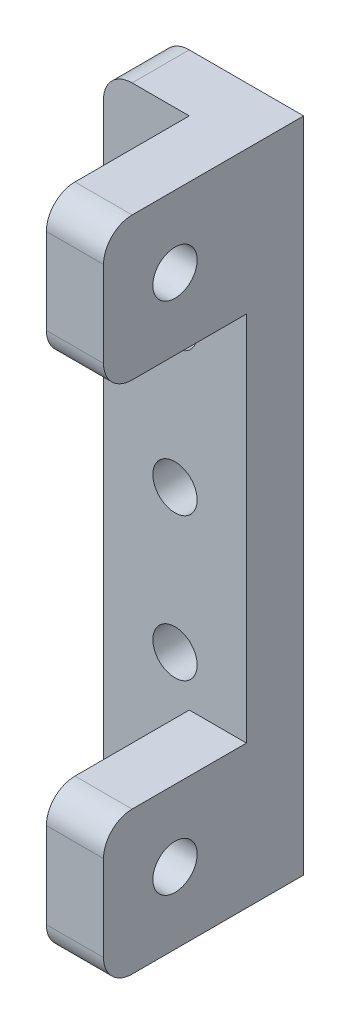
ISO-10303-21;
HEADER;
FILE_DESCRIPTION(('STEP AP214'),'2;1');
FILE_NAME('part.step','',(''),(''),'','','');
FILE_SCHEMA(('AUTOMOTIVE_DESIGN { 1 0 10303 214 1 1 1 1 }'));
ENDSEC;
DATA;
#1=APPLICATION_CONTEXT('core data for automotive mechanical design processes');
#2=APPLICATION_PROTOCOL_DEFINITION('international standard','automotive_design',2000,#1);
#3=PRODUCT_CONTEXT('',#1,'mechanical');
#4=PRODUCT('Part','Part','',(#3));
#5=PRODUCT_RELATED_PRODUCT_CATEGORY('part','',(#4));
#6=PRODUCT_DEFINITION_FORMATION('','',#4);
#7=PRODUCT_DEFINITION_CONTEXT('part definition',#1,'design');
#8=PRODUCT_DEFINITION('design','',#6,#7);
#9=PRODUCT_DEFINITION_SHAPE('','',#8);
#10=(LENGTH_UNIT() NAMED_UNIT(*) SI_UNIT(.MILLI.,.METRE.));
#11=(NAMED_UNIT(*) PLANE_ANGLE_UNIT() SI_UNIT($,.RADIAN.));
#12=(NAMED_UNIT(*) SI_UNIT($,.STERADIAN.) SOLID_ANGLE_UNIT());
#13=UNCERTAINTY_MEASURE_WITH_UNIT(LENGTH_MEASURE(1.E-05),#10,'distance_accuracy_value','');
#14=(GEOMETRIC_REPRESENTATION_CONTEXT(3) GLOBAL_UNCERTAINTY_ASSIGNED_CONTEXT((#13)) GLOBAL_UNIT_ASSIGNED_CONTEXT((#10,
#11,#12)) REPRESENTATION_CONTEXT('',''));
#15=CARTESIAN_POINT('',(0.,0.,0.));
#16=DIRECTION('',(0.,0.,1.));
#17=DIRECTION('',(1.,0.,0.));
#18=AXIS2_PLACEMENT_3D('',#15,#16,#17);
#19=CARTESIAN_POINT('',(0.,0.,4.));
#20=DIRECTION('',(0.,0.,-1.));
#21=DIRECTION('',(-1.,0.,0.));
#22=AXIS2_PLACEMENT_3D('',#19,#20,#21);
#23=PLANE('',#22);
#24=CARTESIAN_POINT('',(0.,10.,4.));
#25=DIRECTION('',(0.,0.,1.));
#26=DIRECTION('',(1.,0.,0.));
#27=AXIS2_PLACEMENT_3D('',#24,#25,#26);
#28=CIRCLE('',#27,1.55);
#29=CARTESIAN_POINT('',(1.55,10.,4.));
#30=VERTEX_POINT('',#29);
#31=EDGE_CURVE('E193',#30,#30,#28,.T.);
#32=ORIENTED_EDGE('',*,*,#31,.F.);
#33=EDGE_LOOP('',(#32));
#34=FACE_BOUND('',#33,.T.);
#35=CARTESIAN_POINT('',(0.,0.,4.));
#36=DIRECTION('',(0.,0.,1.));
#37=DIRECTION('',(1.,0.,0.));
#38=AXIS2_PLACEMENT_3D('',#35,#36,#37);
#39=CIRCLE('',#38,1.55);
#40=CARTESIAN_POINT('',(1.55,0.,4.));
#41=VERTEX_POINT('',#40);
#42=EDGE_CURVE('E187',#41,#41,#39,.T.);
#43=ORIENTED_EDGE('',*,*,#42,.F.);
#44=EDGE_LOOP('',(#43));
#45=FACE_BOUND('',#44,.T.);
#46=CARTESIAN_POINT('',(0.,-10.,4.));
#47=DIRECTION('',(0.,0.,1.));
#48=DIRECTION('',(1.,0.,0.));
#49=AXIS2_PLACEMENT_3D('',#46,#47,#48);
#50=CIRCLE('',#49,1.55);
#51=CARTESIAN_POINT('',(1.55,-10.,4.));
#52=VERTEX_POINT('',#51);
#53=EDGE_CURVE('E181',#52,#52,#50,.T.);
#54=ORIENTED_EDGE('',*,*,#53,.F.);
#55=EDGE_LOOP('',(#54));
#56=FACE_BOUND('',#55,.T.);
#57=DIRECTION('',(-1.,0.,0.));
#58=VECTOR('',#57,1.);
#59=CARTESIAN_POINT('',(-5.,23.,4.));
#60=LINE('',#59,#58);
#61=CARTESIAN_POINT('',(0.999999999999999,23.,4.));
#62=VERTEX_POINT('',#61);
#63=CARTESIAN_POINT('',(-3.,23.,4.));
#64=VERTEX_POINT('',#63);
#65=EDGE_CURVE('E200',#62,#64,#60,.T.);
#66=ORIENTED_EDGE('',*,*,#65,.T.);
#67=CARTESIAN_POINT('',(-3.,21.,4.));
#68=DIRECTION('',(0.,0.,-1.));
#69=DIRECTION('',(-1.,0.,0.));
#70=AXIS2_PLACEMENT_3D('',#67,#68,#69);
#71=CIRCLE('',#70,2.);
#72=CARTESIAN_POINT('',(-5.,21.,4.));
#73=VERTEX_POINT('',#72);
#74=EDGE_CURVE('E256',#64,#73,#71,.F.);
#75=ORIENTED_EDGE('',*,*,#74,.T.);
#76=DIRECTION('',(0.,-1.,0.));
#77=VECTOR('',#76,1.);
#78=CARTESIAN_POINT('',(-5.,-23.,4.));
#79=LINE('',#78,#77);
#80=CARTESIAN_POINT('',(-5.,-21.,4.));
#81=VERTEX_POINT('',#80);
#82=EDGE_CURVE('E203',#73,#81,#79,.T.);
#83=ORIENTED_EDGE('',*,*,#82,.T.);
#84=CARTESIAN_POINT('',(-3.,-21.,4.));
#85=DIRECTION('',(0.,0.,-1.));
#86=DIRECTION('',(-1.,0.,0.));
#87=AXIS2_PLACEMENT_3D('',#84,#85,#86);
#88=CIRCLE('',#87,2.);
#89=CARTESIAN_POINT('',(-3.,-23.,4.));
#90=VERTEX_POINT('',#89);
#91=EDGE_CURVE('E254',#81,#90,#88,.F.);
#92=ORIENTED_EDGE('',*,*,#91,.T.);
#93=DIRECTION('',(1.,0.,0.));
#94=VECTOR('',#93,1.);
#95=CARTESIAN_POINT('',(-5.,-23.,4.));
#96=LINE('',#95,#94);
#97=CARTESIAN_POINT('',(1.00000000000001,-23.,4.));
#98=VERTEX_POINT('',#97);
#99=EDGE_CURVE('E206',#90,#98,#96,.T.);
#100=ORIENTED_EDGE('',*,*,#99,.T.);
#101=DIRECTION('',(0.,-1.,0.));
#102=VECTOR('',#101,1.);
#103=CARTESIAN_POINT('',(1.00000000000001,-23.,4.));
#104=LINE('',#103,#102);
#105=CARTESIAN_POINT('',(1.00000000000001,-13.,4.));
#106=VERTEX_POINT('',#105);
#107=EDGE_CURVE('E284',#106,#98,#104,.T.);
#108=ORIENTED_EDGE('',*,*,#107,.F.);
#109=DIRECTION('',(-1.,0.,0.));
#110=VECTOR('',#109,1.);
#111=CARTESIAN_POINT('',(5.00000000000001,-13.,4.));
#112=LINE('',#111,#110);
#113=CARTESIAN_POINT('',(5.,-13.,4.));
#114=VERTEX_POINT('',#113);
#115=EDGE_CURVE('E288',#114,#106,#112,.T.);
#116=ORIENTED_EDGE('',*,*,#115,.F.);
#117=DIRECTION('',(0.,1.,0.));
#118=VECTOR('',#117,1.);
#119=CARTESIAN_POINT('',(5.,-23.,4.));
#120=LINE('',#119,#118);
#121=CARTESIAN_POINT('',(5.,13.,4.));
#122=VERTEX_POINT('',#121);
#123=EDGE_CURVE('E164',#114,#122,#120,.T.);
#124=ORIENTED_EDGE('',*,*,#123,.T.);
#125=DIRECTION('',(1.,0.,0.));
#126=VECTOR('',#125,1.);
#127=CARTESIAN_POINT('',(5.,13.,4.));
#128=LINE('',#127,#126);
#129=CARTESIAN_POINT('',(1.,13.,4.));
#130=VERTEX_POINT('',#129);
#131=EDGE_CURVE('E147',#130,#122,#128,.T.);
#132=ORIENTED_EDGE('',*,*,#131,.F.);
#133=DIRECTION('',(0.,-1.,0.));
#134=VECTOR('',#133,1.);
#135=CARTESIAN_POINT('',(0.999999999999999,23.,4.));
#136=LINE('',#135,#134);
#137=EDGE_CURVE('E160',#62,#130,#136,.T.);
#138=ORIENTED_EDGE('',*,*,#137,.F.);
#139=EDGE_LOOP('',(#66,#75,#83,#92,#100,#108,#116,#124,#132,#138));
#140=FACE_BOUND('',#139,.T.);
#141=ADVANCED_FACE('F32',(#34,#45,#56,#140),#23,.F.);
#142=CARTESIAN_POINT('',(0.,0.,0.));
#143=DIRECTION('',(0.,0.,-1.));
#144=DIRECTION('',(-1.,0.,0.));
#145=AXIS2_PLACEMENT_3D('',#142,#143,#144);
#146=PLANE('',#145);
#147=CARTESIAN_POINT('',(0.,0.,0.));
#148=DIRECTION('',(0.,0.,1.));
#149=DIRECTION('',(1.,0.,0.));
#150=AXIS2_PLACEMENT_3D('',#147,#148,#149);
#151=CIRCLE('',#150,1.55);
#152=CARTESIAN_POINT('',(1.55,0.,0.));
#153=VERTEX_POINT('',#152);
#154=EDGE_CURVE('E184',#153,#153,#151,.T.);
#155=ORIENTED_EDGE('',*,*,#154,.T.);
#156=EDGE_LOOP('',(#155));
#157=FACE_BOUND('',#156,.T.);
#158=DIRECTION('',(0.,-1.,0.));
#159=VECTOR('',#158,1.);
#160=CARTESIAN_POINT('',(-5.,-23.,0.));
#161=LINE('',#160,#159);
#162=CARTESIAN_POINT('',(-5.,21.,0.));
#163=VERTEX_POINT('',#162);
#164=CARTESIAN_POINT('',(-5.,-21.,0.));
#165=VERTEX_POINT('',#164);
#166=EDGE_CURVE('E215',#163,#165,#161,.T.);
#167=ORIENTED_EDGE('',*,*,#166,.F.);
#168=CARTESIAN_POINT('',(-3.,21.,0.));
#169=DIRECTION('',(0.,0.,-1.));
#170=DIRECTION('',(-1.,0.,0.));
#171=AXIS2_PLACEMENT_3D('',#168,#169,#170);
#172=CIRCLE('',#171,2.);
#173=CARTESIAN_POINT('',(-3.,23.,0.));
#174=VERTEX_POINT('',#173);
#175=EDGE_CURVE('E252',#163,#174,#172,.T.);
#176=ORIENTED_EDGE('',*,*,#175,.T.);
#177=DIRECTION('',(-1.,0.,0.));
#178=VECTOR('',#177,1.);
#179=CARTESIAN_POINT('',(-5.,23.,0.));
#180=LINE('',#179,#178);
#181=CARTESIAN_POINT('',(5.,23.,0.));
#182=VERTEX_POINT('',#181);
#183=EDGE_CURVE('E212',#182,#174,#180,.T.);
#184=ORIENTED_EDGE('',*,*,#183,.F.);
#185=DIRECTION('',(0.,1.,0.));
#186=VECTOR('',#185,1.);
#187=CARTESIAN_POINT('',(5.,-23.,0.));
#188=LINE('',#187,#186);
#189=CARTESIAN_POINT('',(5.,-23.,0.));
#190=VERTEX_POINT('',#189);
#191=EDGE_CURVE('E196',#190,#182,#188,.T.);
#192=ORIENTED_EDGE('',*,*,#191,.F.);
#193=DIRECTION('',(1.,0.,0.));
#194=VECTOR('',#193,1.);
#195=CARTESIAN_POINT('',(-5.,-23.,0.));
#196=LINE('',#195,#194);
#197=CARTESIAN_POINT('',(-3.,-23.,0.));
#198=VERTEX_POINT('',#197);
#199=EDGE_CURVE('E201',#198,#190,#196,.T.);
#200=ORIENTED_EDGE('',*,*,#199,.F.);
#201=CARTESIAN_POINT('',(-3.,-21.,0.));
#202=DIRECTION('',(0.,0.,-1.));
#203=DIRECTION('',(-1.,0.,0.));
#204=AXIS2_PLACEMENT_3D('',#201,#202,#203);
#205=CIRCLE('',#204,2.);
#206=EDGE_CURVE('E250',#198,#165,#205,.T.);
#207=ORIENTED_EDGE('',*,*,#206,.T.);
#208=EDGE_LOOP('',(#167,#176,#184,#192,#200,#207));
#209=FACE_BOUND('',#208,.T.);
#210=CARTESIAN_POINT('',(0.,10.,0.));
#211=DIRECTION('',(0.,0.,1.));
#212=DIRECTION('',(1.,0.,0.));
#213=AXIS2_PLACEMENT_3D('',#210,#211,#212);
#214=CIRCLE('',#213,1.55);
#215=CARTESIAN_POINT('',(1.55,10.,0.));
#216=VERTEX_POINT('',#215);
#217=EDGE_CURVE('E190',#216,#216,#214,.T.);
#218=ORIENTED_EDGE('',*,*,#217,.T.);
#219=EDGE_LOOP('',(#218));
#220=FACE_BOUND('',#219,.T.);
#221=CARTESIAN_POINT('',(0.,-10.,0.));
#222=DIRECTION('',(0.,0.,1.));
#223=DIRECTION('',(1.,0.,0.));
#224=AXIS2_PLACEMENT_3D('',#221,#222,#223);
#225=CIRCLE('',#224,1.55);
#226=CARTESIAN_POINT('',(1.55,-10.,0.));
#227=VERTEX_POINT('',#226);
#228=EDGE_CURVE('E180',#227,#227,#225,.T.);
#229=ORIENTED_EDGE('',*,*,#228,.T.);
#230=EDGE_LOOP('',(#229));
#231=FACE_BOUND('',#230,.T.);
#232=ADVANCED_FACE('F323',(#157,#209,#220,#231),#146,.T.);
#233=CARTESIAN_POINT('',(5.,-23.,4.));
#234=DIRECTION('',(-1.,0.,0.));
#235=DIRECTION('',(0.,-1.,0.));
#236=AXIS2_PLACEMENT_3D('',#233,#234,#235);
#237=PLANE('',#236);
#238=CARTESIAN_POINT('',(5.,-18.,9.));
#239=DIRECTION('',(-1.,0.,0.));
#240=DIRECTION('',(0.,-1.,0.));
#241=AXIS2_PLACEMENT_3D('',#238,#239,#240);
#242=CIRCLE('',#241,1.55);
#243=CARTESIAN_POINT('',(5.,-19.55,9.));
#244=VERTEX_POINT('',#243);
#245=EDGE_CURVE('E291',#244,#244,#242,.F.);
#246=ORIENTED_EDGE('',*,*,#245,.F.);
#247=EDGE_LOOP('',(#246));
#248=FACE_BOUND('',#247,.T.);
#249=CARTESIAN_POINT('',(5.,18.,9.));
#250=DIRECTION('',(-1.,0.,0.));
#251=DIRECTION('',(0.,-1.,0.));
#252=AXIS2_PLACEMENT_3D('',#249,#250,#251);
#253=CIRCLE('',#252,1.55);
#254=CARTESIAN_POINT('',(5.,16.45,9.));
#255=VERTEX_POINT('',#254);
#256=EDGE_CURVE('E568',#255,#255,#253,.F.);
#257=ORIENTED_EDGE('',*,*,#256,.F.);
#258=EDGE_LOOP('',(#257));
#259=FACE_BOUND('',#258,.T.);
#260=DIRECTION('',(0.,0.,-1.));
#261=VECTOR('',#260,1.);
#262=CARTESIAN_POINT('',(5.,23.,4.));
#263=LINE('',#262,#261);
#264=CARTESIAN_POINT('',(5.,23.,12.));
#265=VERTEX_POINT('',#264);
#266=EDGE_CURVE('E221',#265,#182,#263,.T.);
#267=ORIENTED_EDGE('',*,*,#266,.F.);
#268=CARTESIAN_POINT('',(5.,21.,12.));
#269=DIRECTION('',(-1.,0.,0.));
#270=DIRECTION('',(0.,-1.,0.));
#271=AXIS2_PLACEMENT_3D('',#268,#269,#270);
#272=CIRCLE('',#271,2.);
#273=CARTESIAN_POINT('',(5.,21.,14.));
#274=VERTEX_POINT('',#273);
#275=EDGE_CURVE('E243',#265,#274,#272,.F.);
#276=ORIENTED_EDGE('',*,*,#275,.T.);
#277=DIRECTION('',(0.,1.,0.));
#278=VECTOR('',#277,1.);
#279=CARTESIAN_POINT('',(5.,23.,14.));
#280=LINE('',#279,#278);
#281=CARTESIAN_POINT('',(5.,15.,14.));
#282=VERTEX_POINT('',#281);
#283=EDGE_CURVE('E165',#282,#274,#280,.T.);
#284=ORIENTED_EDGE('',*,*,#283,.F.);
#285=CARTESIAN_POINT('',(5.,15.,12.));
#286=DIRECTION('',(-1.,0.,0.));
#287=DIRECTION('',(0.,-1.,0.));
#288=AXIS2_PLACEMENT_3D('',#285,#286,#287);
#289=CIRCLE('',#288,2.);
#290=CARTESIAN_POINT('',(5.,13.,12.));
#291=VERTEX_POINT('',#290);
#292=EDGE_CURVE('E241',#282,#291,#289,.F.);
#293=ORIENTED_EDGE('',*,*,#292,.T.);
#294=DIRECTION('',(0.,0.,-1.));
#295=VECTOR('',#294,1.);
#296=CARTESIAN_POINT('',(5.,13.,14.));
#297=LINE('',#296,#295);
#298=EDGE_CURVE('E154',#291,#122,#297,.T.);
#299=ORIENTED_EDGE('',*,*,#298,.T.);
#300=ORIENTED_EDGE('',*,*,#123,.F.);
#301=DIRECTION('',(0.,0.,-1.));
#302=VECTOR('',#301,1.);
#303=CARTESIAN_POINT('',(5.00000000000001,-13.,14.));
#304=LINE('',#303,#302);
#305=CARTESIAN_POINT('',(5.00000000000001,-13.,12.));
#306=VERTEX_POINT('',#305);
#307=EDGE_CURVE('E170',#306,#114,#304,.T.);
#308=ORIENTED_EDGE('',*,*,#307,.F.);
#309=CARTESIAN_POINT('',(5.,-15.,12.));
#310=DIRECTION('',(-1.,0.,0.));
#311=DIRECTION('',(0.,-1.,0.));
#312=AXIS2_PLACEMENT_3D('',#309,#310,#311);
#313=CIRCLE('',#312,2.);
#314=CARTESIAN_POINT('',(5.,-15.,14.));
#315=VERTEX_POINT('',#314);
#316=EDGE_CURVE('E239',#306,#315,#313,.F.);
#317=ORIENTED_EDGE('',*,*,#316,.T.);
#318=DIRECTION('',(0.,1.,0.));
#319=VECTOR('',#318,1.);
#320=CARTESIAN_POINT('',(5.,-23.,14.));
#321=LINE('',#320,#319);
#322=CARTESIAN_POINT('',(5.,-21.,14.));
#323=VERTEX_POINT('',#322);
#324=EDGE_CURVE('E277',#323,#315,#321,.T.);
#325=ORIENTED_EDGE('',*,*,#324,.F.);
#326=CARTESIAN_POINT('',(5.,-21.,12.));
#327=DIRECTION('',(-1.,0.,0.));
#328=DIRECTION('',(0.,-1.,0.));
#329=AXIS2_PLACEMENT_3D('',#326,#327,#328);
#330=CIRCLE('',#329,2.);
#331=CARTESIAN_POINT('',(5.,-23.,12.));
#332=VERTEX_POINT('',#331);
#333=EDGE_CURVE('E237',#323,#332,#330,.F.);
#334=ORIENTED_EDGE('',*,*,#333,.T.);
#335=DIRECTION('',(0.,0.,-1.));
#336=VECTOR('',#335,1.);
#337=CARTESIAN_POINT('',(5.,-23.,4.));
#338=LINE('',#337,#336);
#339=EDGE_CURVE('E209',#332,#190,#338,.T.);
#340=ORIENTED_EDGE('',*,*,#339,.T.);
#341=ORIENTED_EDGE('',*,*,#191,.T.);
#342=EDGE_LOOP('',(#267,#276,#284,#293,#299,#300,#308,#317,#325,#334,#340,#341));
#343=FACE_BOUND('',#342,.T.);
#344=ADVANCED_FACE('F305',(#248,#259,#343),#237,.F.);
#345=CARTESIAN_POINT('',(-5.,23.,4.));
#346=DIRECTION('',(0.,-1.,0.));
#347=DIRECTION('',(0.,0.,-1.));
#348=AXIS2_PLACEMENT_3D('',#345,#346,#347);
#349=PLANE('',#348);
#350=DIRECTION('',(0.,0.,-1.));
#351=VECTOR('',#350,1.);
#352=CARTESIAN_POINT('',(0.999999999999999,23.,14.));
#353=LINE('',#352,#351);
#354=CARTESIAN_POINT('',(0.999999999999999,23.,12.));
#355=VERTEX_POINT('',#354);
#356=EDGE_CURVE('E153',#355,#62,#353,.T.);
#357=ORIENTED_EDGE('',*,*,#356,.F.);
#358=DIRECTION('',(-1.,0.,0.));
#359=VECTOR('',#358,1.);
#360=CARTESIAN_POINT('',(-5.,23.,12.));
#361=LINE('',#360,#359);
#362=EDGE_CURVE('E235',#355,#265,#361,.F.);
#363=ORIENTED_EDGE('',*,*,#362,.T.);
#364=ORIENTED_EDGE('',*,*,#266,.T.);
#365=ORIENTED_EDGE('',*,*,#183,.T.);
#366=DIRECTION('',(0.,0.,-1.));
#367=VECTOR('',#366,1.);
#368=CARTESIAN_POINT('',(-3.,23.,4.));
#369=LINE('',#368,#367);
#370=EDGE_CURVE('E233',#174,#64,#369,.F.);
#371=ORIENTED_EDGE('',*,*,#370,.T.);
#372=ORIENTED_EDGE('',*,*,#65,.F.);
#373=EDGE_LOOP('',(#357,#363,#364,#365,#371,#372));
#374=FACE_BOUND('',#373,.T.);
#375=ADVANCED_FACE('F311',(#374),#349,.F.);
#376=CARTESIAN_POINT('',(-5.,-23.,4.));
#377=DIRECTION('',(1.,0.,0.));
#378=DIRECTION('',(0.,1.,0.));
#379=AXIS2_PLACEMENT_3D('',#376,#377,#378);
#380=PLANE('',#379);
#381=ORIENTED_EDGE('',*,*,#82,.F.);
#382=DIRECTION('',(0.,0.,-1.));
#383=VECTOR('',#382,1.);
#384=CARTESIAN_POINT('',(-5.,21.,4.));
#385=LINE('',#384,#383);
#386=EDGE_CURVE('E247',#73,#163,#385,.T.);
#387=ORIENTED_EDGE('',*,*,#386,.T.);
#388=ORIENTED_EDGE('',*,*,#166,.T.);
#389=DIRECTION('',(0.,0.,-1.));
#390=VECTOR('',#389,1.);
#391=CARTESIAN_POINT('',(-5.,-21.,4.));
#392=LINE('',#391,#390);
#393=EDGE_CURVE('E245',#165,#81,#392,.F.);
#394=ORIENTED_EDGE('',*,*,#393,.T.);
#395=EDGE_LOOP('',(#381,#387,#388,#394));
#396=FACE_BOUND('',#395,.T.);
#397=ADVANCED_FACE('F320',(#396),#380,.F.);
#398=CARTESIAN_POINT('',(-5.,-23.,4.));
#399=DIRECTION('',(0.,1.,0.));
#400=DIRECTION('',(0.,0.,1.));
#401=AXIS2_PLACEMENT_3D('',#398,#399,#400);
#402=PLANE('',#401);
#403=ORIENTED_EDGE('',*,*,#99,.F.);
#404=DIRECTION('',(0.,0.,-1.));
#405=VECTOR('',#404,1.);
#406=CARTESIAN_POINT('',(-3.,-23.,4.));
#407=LINE('',#406,#405);
#408=EDGE_CURVE('E261',#90,#198,#407,.T.);
#409=ORIENTED_EDGE('',*,*,#408,.T.);
#410=ORIENTED_EDGE('',*,*,#199,.T.);
#411=ORIENTED_EDGE('',*,*,#339,.F.);
#412=DIRECTION('',(1.,0.,0.));
#413=VECTOR('',#412,1.);
#414=CARTESIAN_POINT('',(1.00000000000001,-23.,12.));
#415=LINE('',#414,#413);
#416=CARTESIAN_POINT('',(1.00000000000001,-23.,12.));
#417=VERTEX_POINT('',#416);
#418=EDGE_CURVE('E259',#332,#417,#415,.F.);
#419=ORIENTED_EDGE('',*,*,#418,.T.);
#420=DIRECTION('',(0.,0.,-1.));
#421=VECTOR('',#420,1.);
#422=CARTESIAN_POINT('',(1.00000000000001,-23.,14.));
#423=LINE('',#422,#421);
#424=EDGE_CURVE('E281',#417,#98,#423,.T.);
#425=ORIENTED_EDGE('',*,*,#424,.T.);
#426=EDGE_LOOP('',(#403,#409,#410,#411,#419,#425));
#427=FACE_BOUND('',#426,.T.);
#428=ADVANCED_FACE('F334',(#427),#402,.F.);
#429=CARTESIAN_POINT('',(0.,10.,4.));
#430=DIRECTION('',(0.,0.,-1.));
#431=DIRECTION('',(-1.,0.,0.));
#432=AXIS2_PLACEMENT_3D('',#429,#430,#431);
#433=CYLINDRICAL_SURFACE('',#432,1.55);
#434=ORIENTED_EDGE('',*,*,#31,.T.);
#435=EDGE_LOOP('',(#434));
#436=FACE_BOUND('',#435,.T.);
#437=ORIENTED_EDGE('',*,*,#217,.F.);
#438=EDGE_LOOP('',(#437));
#439=FACE_BOUND('',#438,.T.);
#440=ADVANCED_FACE('F359',(#436,#439),#433,.F.);
#441=CARTESIAN_POINT('',(0.,0.,4.));
#442=DIRECTION('',(0.,0.,-1.));
#443=DIRECTION('',(-1.,0.,0.));
#444=AXIS2_PLACEMENT_3D('',#441,#442,#443);
#445=CYLINDRICAL_SURFACE('',#444,1.55);
#446=ORIENTED_EDGE('',*,*,#42,.T.);
#447=EDGE_LOOP('',(#446));
#448=FACE_BOUND('',#447,.T.);
#449=ORIENTED_EDGE('',*,*,#154,.F.);
#450=EDGE_LOOP('',(#449));
#451=FACE_BOUND('',#450,.T.);
#452=ADVANCED_FACE('F518',(#448,#451),#445,.F.);
#453=CARTESIAN_POINT('',(0.,-10.,4.));
#454=DIRECTION('',(0.,0.,-1.));
#455=DIRECTION('',(-1.,0.,0.));
#456=AXIS2_PLACEMENT_3D('',#453,#454,#455);
#457=CYLINDRICAL_SURFACE('',#456,1.55);
#458=ORIENTED_EDGE('',*,*,#53,.T.);
#459=EDGE_LOOP('',(#458));
#460=FACE_BOUND('',#459,.T.);
#461=ORIENTED_EDGE('',*,*,#228,.F.);
#462=EDGE_LOOP('',(#461));
#463=FACE_BOUND('',#462,.T.);
#464=ADVANCED_FACE('F471',(#460,#463),#457,.F.);
#465=CARTESIAN_POINT('',(0.999999999999999,23.,14.));
#466=DIRECTION('',(1.,0.,0.));
#467=DIRECTION('',(0.,1.,0.));
#468=AXIS2_PLACEMENT_3D('',#465,#466,#467);
#469=PLANE('',#468);
#470=CARTESIAN_POINT('',(0.999999999999999,18.,9.));
#471=DIRECTION('',(-1.,0.,0.));
#472=DIRECTION('',(0.,-1.,0.));
#473=AXIS2_PLACEMENT_3D('',#470,#471,#472);
#474=CIRCLE('',#473,1.55);
#475=CARTESIAN_POINT('',(0.999999999999999,16.45,9.));
#476=VERTEX_POINT('',#475);
#477=EDGE_CURVE('E567',#476,#476,#474,.T.);
#478=ORIENTED_EDGE('',*,*,#477,.F.);
#479=EDGE_LOOP('',(#478));
#480=FACE_BOUND('',#479,.T.);
#481=DIRECTION('',(0.,-1.,0.));
#482=VECTOR('',#481,1.);
#483=CARTESIAN_POINT('',(0.999999999999999,23.,14.));
#484=LINE('',#483,#482);
#485=CARTESIAN_POINT('',(0.999999999999999,21.,14.));
#486=VERTEX_POINT('',#485);
#487=CARTESIAN_POINT('',(1.,15.,14.));
#488=VERTEX_POINT('',#487);
#489=EDGE_CURVE('E175',#486,#488,#484,.T.);
#490=ORIENTED_EDGE('',*,*,#489,.F.);
#491=CARTESIAN_POINT('',(0.999999999999999,21.,12.));
#492=DIRECTION('',(1.,0.,0.));
#493=DIRECTION('',(0.,1.,0.));
#494=AXIS2_PLACEMENT_3D('',#491,#492,#493);
#495=CIRCLE('',#494,2.);
#496=EDGE_CURVE('E231',#486,#355,#495,.F.);
#497=ORIENTED_EDGE('',*,*,#496,.T.);
#498=ORIENTED_EDGE('',*,*,#356,.T.);
#499=ORIENTED_EDGE('',*,*,#137,.T.);
#500=DIRECTION('',(0.,0.,-1.));
#501=VECTOR('',#500,1.);
#502=CARTESIAN_POINT('',(1.,13.,14.));
#503=LINE('',#502,#501);
#504=CARTESIAN_POINT('',(1.,13.,12.));
#505=VERTEX_POINT('',#504);
#506=EDGE_CURVE('E143',#505,#130,#503,.T.);
#507=ORIENTED_EDGE('',*,*,#506,.F.);
#508=CARTESIAN_POINT('',(1.,15.,12.));
#509=DIRECTION('',(1.,0.,0.));
#510=DIRECTION('',(0.,1.,0.));
#511=AXIS2_PLACEMENT_3D('',#508,#509,#510);
#512=CIRCLE('',#511,2.);
#513=EDGE_CURVE('E229',#505,#488,#512,.F.);
#514=ORIENTED_EDGE('',*,*,#513,.T.);
#515=EDGE_LOOP('',(#490,#497,#498,#499,#507,#514));
#516=FACE_BOUND('',#515,.T.);
#517=ADVANCED_FACE('F168',(#480,#516),#469,.F.);
#518=CARTESIAN_POINT('',(5.,13.,14.));
#519=DIRECTION('',(0.,1.,0.));
#520=DIRECTION('',(0.,0.,1.));
#521=AXIS2_PLACEMENT_3D('',#518,#519,#520);
#522=PLANE('',#521);
#523=ORIENTED_EDGE('',*,*,#298,.F.);
#524=DIRECTION('',(1.,0.,0.));
#525=VECTOR('',#524,1.);
#526=CARTESIAN_POINT('',(5.,13.,12.));
#527=LINE('',#526,#525);
#528=EDGE_CURVE('E149',#291,#505,#527,.F.);
#529=ORIENTED_EDGE('',*,*,#528,.T.);
#530=ORIENTED_EDGE('',*,*,#506,.T.);
#531=ORIENTED_EDGE('',*,*,#131,.T.);
#532=EDGE_LOOP('',(#523,#529,#530,#531));
#533=FACE_BOUND('',#532,.T.);
#534=ADVANCED_FACE('F146',(#533),#522,.F.);
#535=CARTESIAN_POINT('',(0.,0.,14.));
#536=DIRECTION('',(0.,0.,-1.));
#537=DIRECTION('',(-1.,0.,0.));
#538=AXIS2_PLACEMENT_3D('',#535,#536,#537);
#539=PLANE('',#538);
#540=ORIENTED_EDGE('',*,*,#283,.T.);
#541=DIRECTION('',(-1.,0.,0.));
#542=VECTOR('',#541,1.);
#543=CARTESIAN_POINT('',(0.,21.,14.));
#544=LINE('',#543,#542);
#545=EDGE_CURVE('E226',#274,#486,#544,.T.);
#546=ORIENTED_EDGE('',*,*,#545,.T.);
#547=ORIENTED_EDGE('',*,*,#489,.T.);
#548=DIRECTION('',(1.,0.,0.));
#549=VECTOR('',#548,1.);
#550=CARTESIAN_POINT('',(0.,15.,14.));
#551=LINE('',#550,#549);
#552=EDGE_CURVE('E223',#488,#282,#551,.T.);
#553=ORIENTED_EDGE('',*,*,#552,.T.);
#554=EDGE_LOOP('',(#540,#546,#547,#553));
#555=FACE_BOUND('',#554,.T.);
#556=ADVANCED_FACE('F300',(#555),#539,.F.);
#557=CARTESIAN_POINT('',(5.00000000000001,-13.,14.));
#558=DIRECTION('',(0.,-1.,0.));
#559=DIRECTION('',(1.,0.,0.));
#560=AXIS2_PLACEMENT_3D('',#557,#558,#559);
#561=PLANE('',#560);
#562=DIRECTION('',(0.,0.,-1.));
#563=VECTOR('',#562,1.);
#564=CARTESIAN_POINT('',(1.00000000000001,-13.,14.));
#565=LINE('',#564,#563);
#566=CARTESIAN_POINT('',(1.00000000000001,-13.,12.));
#567=VERTEX_POINT('',#566);
#568=EDGE_CURVE('E172',#567,#106,#565,.T.);
#569=ORIENTED_EDGE('',*,*,#568,.F.);
#570=DIRECTION('',(-1.,0.,0.));
#571=VECTOR('',#570,1.);
#572=CARTESIAN_POINT('',(5.00000000000001,-13.,12.));
#573=LINE('',#572,#571);
#574=EDGE_CURVE('E11',#567,#306,#573,.F.);
#575=ORIENTED_EDGE('',*,*,#574,.T.);
#576=ORIENTED_EDGE('',*,*,#307,.T.);
#577=ORIENTED_EDGE('',*,*,#115,.T.);
#578=EDGE_LOOP('',(#569,#575,#576,#577));
#579=FACE_BOUND('',#578,.T.);
#580=ADVANCED_FACE('F339',(#579),#561,.F.);
#581=CARTESIAN_POINT('',(1.00000000000001,-23.,14.));
#582=DIRECTION('',(1.,0.,0.));
#583=DIRECTION('',(0.,0.,-1.));
#584=AXIS2_PLACEMENT_3D('',#581,#582,#583);
#585=PLANE('',#584);
#586=CARTESIAN_POINT('',(1.,-18.,9.));
#587=DIRECTION('',(-1.,0.,0.));
#588=DIRECTION('',(0.,-1.,0.));
#589=AXIS2_PLACEMENT_3D('',#586,#587,#588);
#590=CIRCLE('',#589,1.55);
#591=CARTESIAN_POINT('',(1.,-19.55,9.));
#592=VERTEX_POINT('',#591);
#593=EDGE_CURVE('E571',#592,#592,#590,.T.);
#594=ORIENTED_EDGE('',*,*,#593,.F.);
#595=EDGE_LOOP('',(#594));
#596=FACE_BOUND('',#595,.T.);
#597=DIRECTION('',(0.,-1.,0.));
#598=VECTOR('',#597,1.);
#599=CARTESIAN_POINT('',(1.00000000000001,-23.,14.));
#600=LINE('',#599,#598);
#601=CARTESIAN_POINT('',(1.00000000000001,-15.,14.));
#602=VERTEX_POINT('',#601);
#603=CARTESIAN_POINT('',(1.00000000000001,-21.,14.));
#604=VERTEX_POINT('',#603);
#605=EDGE_CURVE('E274',#602,#604,#600,.T.);
#606=ORIENTED_EDGE('',*,*,#605,.F.);
#607=CARTESIAN_POINT('',(1.00000000000001,-15.,12.));
#608=DIRECTION('',(1.,0.,0.));
#609=DIRECTION('',(0.,0.,-1.));
#610=AXIS2_PLACEMENT_3D('',#607,#608,#609);
#611=CIRCLE('',#610,2.);
#612=EDGE_CURVE('E40',#602,#567,#611,.F.);
#613=ORIENTED_EDGE('',*,*,#612,.T.);
#614=ORIENTED_EDGE('',*,*,#568,.T.);
#615=ORIENTED_EDGE('',*,*,#107,.T.);
#616=ORIENTED_EDGE('',*,*,#424,.F.);
#617=CARTESIAN_POINT('',(1.00000000000001,-21.,12.));
#618=DIRECTION('',(1.,0.,0.));
#619=DIRECTION('',(0.,0.,-1.));
#620=AXIS2_PLACEMENT_3D('',#617,#618,#619);
#621=CIRCLE('',#620,2.);
#622=EDGE_CURVE('E52',#417,#604,#621,.F.);
#623=ORIENTED_EDGE('',*,*,#622,.T.);
#624=EDGE_LOOP('',(#606,#613,#614,#615,#616,#623));
#625=FACE_BOUND('',#624,.T.);
#626=ADVANCED_FACE('F280',(#596,#625),#585,.F.);
#627=CARTESIAN_POINT('',(0.,0.,14.));
#628=DIRECTION('',(0.,0.,1.));
#629=DIRECTION('',(1.,0.,0.));
#630=AXIS2_PLACEMENT_3D('',#627,#628,#629);
#631=PLANE('',#630);
#632=ORIENTED_EDGE('',*,*,#324,.T.);
#633=DIRECTION('',(-1.,0.,0.));
#634=VECTOR('',#633,1.);
#635=CARTESIAN_POINT('',(1.00000000000001,-15.,14.));
#636=LINE('',#635,#634);
#637=EDGE_CURVE('E267',#315,#602,#636,.T.);
#638=ORIENTED_EDGE('',*,*,#637,.T.);
#639=ORIENTED_EDGE('',*,*,#605,.T.);
#640=DIRECTION('',(1.,0.,0.));
#641=VECTOR('',#640,1.);
#642=CARTESIAN_POINT('',(5.,-21.,14.));
#643=LINE('',#642,#641);
#644=EDGE_CURVE('E264',#604,#323,#643,.T.);
#645=ORIENTED_EDGE('',*,*,#644,.T.);
#646=EDGE_LOOP('',(#632,#638,#639,#645));
#647=FACE_BOUND('',#646,.T.);
#648=ADVANCED_FACE('F273',(#647),#631,.T.);
#649=CARTESIAN_POINT('',(5.00100000000001,-18.,9.));
#650=DIRECTION('',(-1.,0.,0.));
#651=DIRECTION('',(0.,-1.,0.));
#652=AXIS2_PLACEMENT_3D('',#649,#650,#651);
#653=CYLINDRICAL_SURFACE('',#652,1.55);
#654=ORIENTED_EDGE('',*,*,#593,.T.);
#655=EDGE_LOOP('',(#654));
#656=FACE_BOUND('',#655,.T.);
#657=ORIENTED_EDGE('',*,*,#245,.T.);
#658=EDGE_LOOP('',(#657));
#659=FACE_BOUND('',#658,.T.);
#660=ADVANCED_FACE('F418',(#656,#659),#653,.F.);
#661=CARTESIAN_POINT('',(5.00100000000001,18.,9.));
#662=DIRECTION('',(-1.,0.,0.));
#663=DIRECTION('',(0.,-1.,0.));
#664=AXIS2_PLACEMENT_3D('',#661,#662,#663);
#665=CYLINDRICAL_SURFACE('',#664,1.55);
#666=ORIENTED_EDGE('',*,*,#477,.T.);
#667=EDGE_LOOP('',(#666));
#668=FACE_BOUND('',#667,.T.);
#669=ORIENTED_EDGE('',*,*,#256,.T.);
#670=EDGE_LOOP('',(#669));
#671=FACE_BOUND('',#670,.T.);
#672=ADVANCED_FACE('F373',(#668,#671),#665,.F.);
#673=CARTESIAN_POINT('',(0.,21.,12.));
#674=DIRECTION('',(-1.,0.,0.));
#675=DIRECTION('',(0.,0.,1.));
#676=AXIS2_PLACEMENT_3D('',#673,#674,#675);
#677=CYLINDRICAL_SURFACE('',#676,2.);
#678=ORIENTED_EDGE('',*,*,#275,.F.);
#679=ORIENTED_EDGE('',*,*,#362,.F.);
#680=ORIENTED_EDGE('',*,*,#496,.F.);
#681=ORIENTED_EDGE('',*,*,#545,.F.);
#682=EDGE_LOOP('',(#678,#679,#680,#681));
#683=FACE_BOUND('',#682,.T.);
#684=ADVANCED_FACE('F309',(#683),#677,.T.);
#685=CARTESIAN_POINT('',(-3.,21.,4.));
#686=DIRECTION('',(0.,0.,-1.));
#687=DIRECTION('',(-1.,0.,0.));
#688=AXIS2_PLACEMENT_3D('',#685,#686,#687);
#689=CYLINDRICAL_SURFACE('',#688,2.);
#690=ORIENTED_EDGE('',*,*,#74,.F.);
#691=ORIENTED_EDGE('',*,*,#370,.F.);
#692=ORIENTED_EDGE('',*,*,#175,.F.);
#693=ORIENTED_EDGE('',*,*,#386,.F.);
#694=EDGE_LOOP('',(#690,#691,#692,#693));
#695=FACE_BOUND('',#694,.T.);
#696=ADVANCED_FACE('F317',(#695),#689,.T.);
#697=CARTESIAN_POINT('',(0.,15.,12.));
#698=DIRECTION('',(1.,0.,0.));
#699=DIRECTION('',(0.,0.,-1.));
#700=AXIS2_PLACEMENT_3D('',#697,#698,#699);
#701=CYLINDRICAL_SURFACE('',#700,2.);
#702=ORIENTED_EDGE('',*,*,#513,.F.);
#703=ORIENTED_EDGE('',*,*,#528,.F.);
#704=ORIENTED_EDGE('',*,*,#292,.F.);
#705=ORIENTED_EDGE('',*,*,#552,.F.);
#706=EDGE_LOOP('',(#702,#703,#704,#705));
#707=FACE_BOUND('',#706,.T.);
#708=ADVANCED_FACE('F302',(#707),#701,.T.);
#709=CARTESIAN_POINT('',(-3.,-21.,4.));
#710=DIRECTION('',(0.,0.,-1.));
#711=DIRECTION('',(-1.,0.,0.));
#712=AXIS2_PLACEMENT_3D('',#709,#710,#711);
#713=CYLINDRICAL_SURFACE('',#712,2.);
#714=ORIENTED_EDGE('',*,*,#91,.F.);
#715=ORIENTED_EDGE('',*,*,#393,.F.);
#716=ORIENTED_EDGE('',*,*,#206,.F.);
#717=ORIENTED_EDGE('',*,*,#408,.F.);
#718=EDGE_LOOP('',(#714,#715,#716,#717));
#719=FACE_BOUND('',#718,.T.);
#720=ADVANCED_FACE('F331',(#719),#713,.T.);
#721=CARTESIAN_POINT('',(0.,-15.,12.));
#722=DIRECTION('',(1.,0.,0.));
#723=DIRECTION('',(0.,1.,0.));
#724=AXIS2_PLACEMENT_3D('',#721,#722,#723);
#725=CYLINDRICAL_SURFACE('',#724,2.);
#726=ORIENTED_EDGE('',*,*,#316,.F.);
#727=ORIENTED_EDGE('',*,*,#574,.F.);
#728=ORIENTED_EDGE('',*,*,#612,.F.);
#729=ORIENTED_EDGE('',*,*,#637,.F.);
#730=EDGE_LOOP('',(#726,#727,#728,#729));
#731=FACE_BOUND('',#730,.T.);
#732=ADVANCED_FACE('F341',(#731),#725,.T.);
#733=CARTESIAN_POINT('',(0.,-21.,12.));
#734=DIRECTION('',(-1.,0.,0.));
#735=DIRECTION('',(0.,0.,1.));
#736=AXIS2_PLACEMENT_3D('',#733,#734,#735);
#737=CYLINDRICAL_SURFACE('',#736,2.);
#738=ORIENTED_EDGE('',*,*,#622,.F.);
#739=ORIENTED_EDGE('',*,*,#418,.F.);
#740=ORIENTED_EDGE('',*,*,#333,.F.);
#741=ORIENTED_EDGE('',*,*,#644,.F.);
#742=EDGE_LOOP('',(#738,#739,#740,#741));
#743=FACE_BOUND('',#742,.T.);
#744=ADVANCED_FACE('F34',(#743),#737,.T.);
#745=CLOSED_SHELL('',(#141,#232,#344,#375,#397,#428,#440,#452,#464,#517,#534,#556,#580,#626,
#648,#660,#672,#684,#696,#708,#720,#732,#744));
#746=MANIFOLD_SOLID_BREP('B2',#745);
#747=ADVANCED_BREP_SHAPE_REPRESENTATION('',(#18,#746),#14);
#748=SHAPE_DEFINITION_REPRESENTATION(#9,#747);
ENDSEC;
END-ISO-10303-21;
